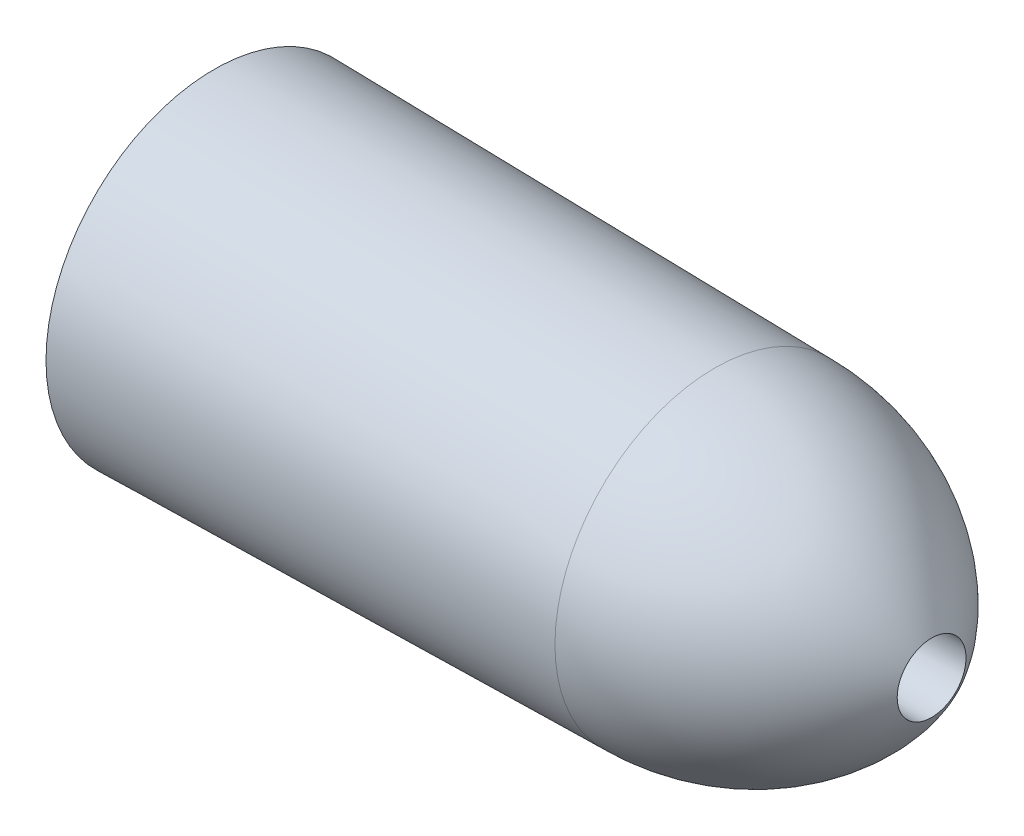
ISO-10303-21;
HEADER;
FILE_DESCRIPTION(('STEP AP214'),'2;1');
FILE_NAME('part.step','',(''),(''),'','','');
FILE_SCHEMA(('AUTOMOTIVE_DESIGN { 1 0 10303 214 1 1 1 1 }'));
ENDSEC;
DATA;
#1=APPLICATION_CONTEXT('core data for automotive mechanical design processes');
#2=APPLICATION_PROTOCOL_DEFINITION('international standard','automotive_design',2000,#1);
#3=PRODUCT_CONTEXT('',#1,'mechanical');
#4=PRODUCT('Part','Part','',(#3));
#5=PRODUCT_RELATED_PRODUCT_CATEGORY('part','',(#4));
#6=PRODUCT_DEFINITION_FORMATION('','',#4);
#7=PRODUCT_DEFINITION_CONTEXT('part definition',#1,'design');
#8=PRODUCT_DEFINITION('design','',#6,#7);
#9=PRODUCT_DEFINITION_SHAPE('','',#8);
#10=(LENGTH_UNIT() NAMED_UNIT(*) SI_UNIT(.MILLI.,.METRE.));
#11=(NAMED_UNIT(*) PLANE_ANGLE_UNIT() SI_UNIT($,.RADIAN.));
#12=(NAMED_UNIT(*) SI_UNIT($,.STERADIAN.) SOLID_ANGLE_UNIT());
#13=UNCERTAINTY_MEASURE_WITH_UNIT(LENGTH_MEASURE(1.E-05),#10,'distance_accuracy_value','');
#14=(GEOMETRIC_REPRESENTATION_CONTEXT(3) GLOBAL_UNCERTAINTY_ASSIGNED_CONTEXT((#13)) GLOBAL_UNIT_ASSIGNED_CONTEXT((#10,
#11,#12)) REPRESENTATION_CONTEXT('',''));
#15=CARTESIAN_POINT('',(0.,0.,0.));
#16=DIRECTION('',(0.,0.,1.));
#17=DIRECTION('',(1.,0.,0.));
#18=AXIS2_PLACEMENT_3D('',#15,#16,#17);
#19=CARTESIAN_POINT('',(-273.05,0.,0.));
#20=DIRECTION('',(-1.,0.,0.));
#21=DIRECTION('',(0.,0.,1.));
#22=AXIS2_PLACEMENT_3D('',#19,#20,#21);
#23=CONICAL_SURFACE('',#22,63.9802871,0.0167076255260351);
#24=CARTESIAN_POINT('',(-82.55,0.,0.));
#25=DIRECTION('',(-1.,0.,0.));
#26=DIRECTION('',(0.,0.,1.));
#27=AXIS2_PLACEMENT_3D('',#24,#25,#26);
#28=CIRCLE('',#27,60.79718825);
#29=CARTESIAN_POINT('',(-82.55,0.,60.79718825));
#30=VERTEX_POINT('',#29);
#31=EDGE_CURVE('E55',#30,#30,#28,.T.);
#32=ORIENTED_EDGE('',*,*,#31,.T.);
#33=EDGE_LOOP('',(#32));
#34=FACE_BOUND('',#33,.T.);
#35=CARTESIAN_POINT('',(-273.05,0.,0.));
#36=DIRECTION('',(-1.,0.,0.));
#37=DIRECTION('',(0.,0.,1.));
#38=AXIS2_PLACEMENT_3D('',#35,#36,#37);
#39=CIRCLE('',#38,63.9802871);
#40=CARTESIAN_POINT('',(-273.05,0.,63.9802871));
#41=VERTEX_POINT('',#40);
#42=EDGE_CURVE('E10',#41,#41,#39,.T.);
#43=ORIENTED_EDGE('',*,*,#42,.F.);
#44=EDGE_LOOP('',(#43));
#45=FACE_BOUND('',#44,.T.);
#46=ADVANCED_FACE('F41',(#34,#45),#23,.T.);
#47=CARTESIAN_POINT('',(-273.05,0.,0.));
#48=DIRECTION('',(-1.,0.,0.));
#49=DIRECTION('',(0.,0.,1.));
#50=AXIS2_PLACEMENT_3D('',#47,#48,#49);
#51=PLANE('',#50);
#52=ORIENTED_EDGE('',*,*,#42,.T.);
#53=EDGE_LOOP('',(#52));
#54=FACE_BOUND('',#53,.T.);
#55=CARTESIAN_POINT('',(-273.05,0.,0.));
#56=DIRECTION('',(-1.,0.,0.));
#57=DIRECTION('',(0.,0.,1.));
#58=AXIS2_PLACEMENT_3D('',#55,#56,#57);
#59=CIRCLE('',#58,12.3);
#60=CARTESIAN_POINT('',(-273.05,0.,12.3));
#61=VERTEX_POINT('',#60);
#62=EDGE_CURVE('E47',#61,#61,#59,.T.);
#63=ORIENTED_EDGE('',*,*,#62,.F.);
#64=EDGE_LOOP('',(#63));
#65=FACE_BOUND('',#64,.T.);
#66=ADVANCED_FACE('F71',(#54,#65),#51,.T.);
#67=CARTESIAN_POINT('',(-273.05,0.,0.));
#68=DIRECTION('',(1.,0.,0.));
#69=DIRECTION('',(0.,0.,-1.));
#70=AXIS2_PLACEMENT_3D('',#67,#68,#69);
#71=CONICAL_SURFACE('',#70,12.3,0.00292985794145398);
#72=CARTESIAN_POINT('',(0.,0.,0.));
#73=DIRECTION('',(-1.,0.,0.));
#74=DIRECTION('',(0.,0.,1.));
#75=AXIS2_PLACEMENT_3D('',#72,#73,#74);
#76=CIRCLE('',#75,13.1);
#77=CARTESIAN_POINT('',(0.,0.,13.1));
#78=VERTEX_POINT('',#77);
#79=EDGE_CURVE('E51',#78,#78,#76,.T.);
#80=ORIENTED_EDGE('',*,*,#79,.F.);
#81=EDGE_LOOP('',(#80));
#82=FACE_BOUND('',#81,.T.);
#83=ORIENTED_EDGE('',*,*,#62,.T.);
#84=EDGE_LOOP('',(#83));
#85=FACE_BOUND('',#84,.T.);
#86=ADVANCED_FACE('F65',(#82,#85),#71,.F.);
#87=CARTESIAN_POINT('',(-82.55,0.,0.));
#88=DIRECTION('',(-1.,0.,0.));
#89=DIRECTION('',(0.,0.,1.));
#90=AXIS2_PLACEMENT_3D('',#87,#88,#89);
#91=DEGENERATE_TOROIDAL_SURFACE('',#90,34.4864605398838,95.2836487898838,.F.);
#92=ORIENTED_EDGE('',*,*,#79,.T.);
#93=EDGE_LOOP('',(#92));
#94=FACE_BOUND('',#93,.T.);
#95=ORIENTED_EDGE('',*,*,#31,.F.);
#96=EDGE_LOOP('',(#95));
#97=FACE_BOUND('',#96,.T.);
#98=ADVANCED_FACE('F63',(#94,#97),#91,.F.);
#99=CLOSED_SHELL('',(#46,#66,#86,#98));
#100=MANIFOLD_SOLID_BREP('B2',#99);
#101=ADVANCED_BREP_SHAPE_REPRESENTATION('',(#18,#100),#14);
#102=SHAPE_DEFINITION_REPRESENTATION(#9,#101);
ENDSEC;
END-ISO-10303-21;
